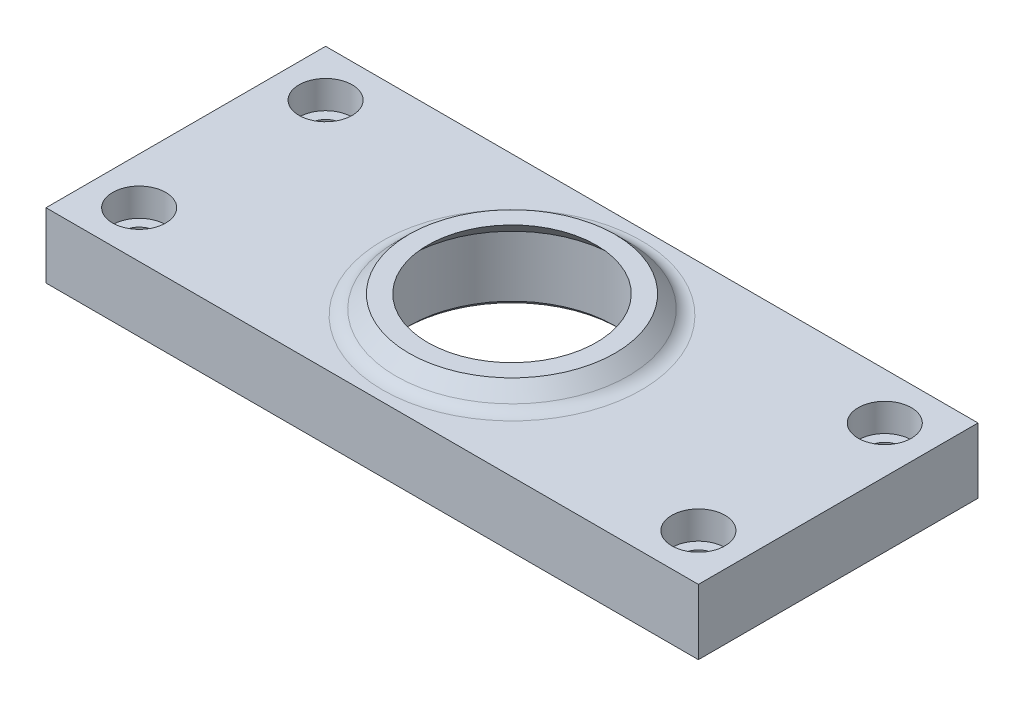
ISO-10303-21;
HEADER;
FILE_DESCRIPTION(('STEP AP214'),'2;1');
FILE_NAME('part.step','',(''),(''),'','','');
FILE_SCHEMA(('AUTOMOTIVE_DESIGN { 1 0 10303 214 1 1 1 1 }'));
ENDSEC;
DATA;
#1=APPLICATION_CONTEXT('core data for automotive mechanical design processes');
#2=APPLICATION_PROTOCOL_DEFINITION('international standard','automotive_design',2000,#1);
#3=PRODUCT_CONTEXT('',#1,'mechanical');
#4=PRODUCT('Part','Part','',(#3));
#5=PRODUCT_RELATED_PRODUCT_CATEGORY('part','',(#4));
#6=PRODUCT_DEFINITION_FORMATION('','',#4);
#7=PRODUCT_DEFINITION_CONTEXT('part definition',#1,'design');
#8=PRODUCT_DEFINITION('design','',#6,#7);
#9=PRODUCT_DEFINITION_SHAPE('','',#8);
#10=(LENGTH_UNIT() NAMED_UNIT(*) SI_UNIT(.MILLI.,.METRE.));
#11=(NAMED_UNIT(*) PLANE_ANGLE_UNIT() SI_UNIT($,.RADIAN.));
#12=(NAMED_UNIT(*) SI_UNIT($,.STERADIAN.) SOLID_ANGLE_UNIT());
#13=UNCERTAINTY_MEASURE_WITH_UNIT(LENGTH_MEASURE(1.E-05),#10,'distance_accuracy_value','');
#14=(GEOMETRIC_REPRESENTATION_CONTEXT(3) GLOBAL_UNCERTAINTY_ASSIGNED_CONTEXT((#13)) GLOBAL_UNIT_ASSIGNED_CONTEXT((#10,
#11,#12)) REPRESENTATION_CONTEXT('',''));
#15=CARTESIAN_POINT('',(0.,0.,0.));
#16=DIRECTION('',(0.,0.,1.));
#17=DIRECTION('',(1.,0.,0.));
#18=AXIS2_PLACEMENT_3D('',#15,#16,#17);
#19=CARTESIAN_POINT('',(30.,0.,10.));
#20=DIRECTION('',(0.,1.,0.));
#21=DIRECTION('',(0.,0.,1.));
#22=AXIS2_PLACEMENT_3D('',#19,#20,#21);
#23=CYLINDRICAL_SURFACE('',#22,1.7);
#24=CARTESIAN_POINT('',(30.,0.,10.));
#25=DIRECTION('',(0.,-1.,0.));
#26=DIRECTION('',(0.,0.,1.));
#27=AXIS2_PLACEMENT_3D('',#24,#25,#26);
#28=CIRCLE('',#27,1.7);
#29=CARTESIAN_POINT('',(30.,0.,11.7));
#30=VERTEX_POINT('',#29);
#31=EDGE_CURVE('E120',#30,#30,#28,.T.);
#32=ORIENTED_EDGE('',*,*,#31,.T.);
#33=EDGE_LOOP('',(#32));
#34=FACE_BOUND('',#33,.T.);
#35=CARTESIAN_POINT('',(30.,4.,10.));
#36=DIRECTION('',(0.,1.,0.));
#37=DIRECTION('',(0.,0.,1.));
#38=AXIS2_PLACEMENT_3D('',#35,#36,#37);
#39=CIRCLE('',#38,1.7);
#40=CARTESIAN_POINT('',(30.,4.,11.7));
#41=VERTEX_POINT('',#40);
#42=EDGE_CURVE('E182',#41,#41,#39,.T.);
#43=ORIENTED_EDGE('',*,*,#42,.T.);
#44=EDGE_LOOP('',(#43));
#45=FACE_BOUND('',#44,.T.);
#46=ADVANCED_FACE('F49',(#34,#45),#23,.F.);
#47=CARTESIAN_POINT('',(30.,0.,-10.));
#48=DIRECTION('',(0.,1.,0.));
#49=DIRECTION('',(0.,0.,1.));
#50=AXIS2_PLACEMENT_3D('',#47,#48,#49);
#51=CYLINDRICAL_SURFACE('',#50,1.7);
#52=CARTESIAN_POINT('',(30.,0.,-10.));
#53=DIRECTION('',(0.,-1.,0.));
#54=DIRECTION('',(0.,0.,1.));
#55=AXIS2_PLACEMENT_3D('',#52,#53,#54);
#56=CIRCLE('',#55,1.7);
#57=CARTESIAN_POINT('',(30.,0.,-8.3));
#58=VERTEX_POINT('',#57);
#59=EDGE_CURVE('E116',#58,#58,#56,.T.);
#60=ORIENTED_EDGE('',*,*,#59,.T.);
#61=EDGE_LOOP('',(#60));
#62=FACE_BOUND('',#61,.T.);
#63=CARTESIAN_POINT('',(30.,4.,-10.));
#64=DIRECTION('',(0.,1.,0.));
#65=DIRECTION('',(0.,0.,1.));
#66=AXIS2_PLACEMENT_3D('',#63,#64,#65);
#67=CIRCLE('',#66,1.7);
#68=CARTESIAN_POINT('',(30.,4.,-8.3));
#69=VERTEX_POINT('',#68);
#70=EDGE_CURVE('E178',#69,#69,#67,.T.);
#71=ORIENTED_EDGE('',*,*,#70,.T.);
#72=EDGE_LOOP('',(#71));
#73=FACE_BOUND('',#72,.T.);
#74=ADVANCED_FACE('F210',(#62,#73),#51,.F.);
#75=CARTESIAN_POINT('',(-30.,0.,10.));
#76=DIRECTION('',(0.,1.,0.));
#77=DIRECTION('',(0.,0.,1.));
#78=AXIS2_PLACEMENT_3D('',#75,#76,#77);
#79=CYLINDRICAL_SURFACE('',#78,1.7);
#80=CARTESIAN_POINT('',(-30.,0.,10.));
#81=DIRECTION('',(0.,1.,0.));
#82=DIRECTION('',(0.,0.,1.));
#83=AXIS2_PLACEMENT_3D('',#80,#81,#82);
#84=CIRCLE('',#83,1.7);
#85=CARTESIAN_POINT('',(-30.,0.,11.7));
#86=VERTEX_POINT('',#85);
#87=EDGE_CURVE('E150',#86,#86,#84,.T.);
#88=ORIENTED_EDGE('',*,*,#87,.F.);
#89=EDGE_LOOP('',(#88));
#90=FACE_BOUND('',#89,.T.);
#91=CARTESIAN_POINT('',(-30.,4.,10.));
#92=DIRECTION('',(0.,1.,0.));
#93=DIRECTION('',(0.,0.,1.));
#94=AXIS2_PLACEMENT_3D('',#91,#92,#93);
#95=CIRCLE('',#94,1.7);
#96=CARTESIAN_POINT('',(-30.,4.,11.7));
#97=VERTEX_POINT('',#96);
#98=EDGE_CURVE('E154',#97,#97,#95,.F.);
#99=ORIENTED_EDGE('',*,*,#98,.F.);
#100=EDGE_LOOP('',(#99));
#101=FACE_BOUND('',#100,.T.);
#102=ADVANCED_FACE('F216',(#90,#101),#79,.F.);
#103=CARTESIAN_POINT('',(-30.,0.,-10.));
#104=DIRECTION('',(0.,1.,0.));
#105=DIRECTION('',(0.,0.,1.));
#106=AXIS2_PLACEMENT_3D('',#103,#104,#105);
#107=CYLINDRICAL_SURFACE('',#106,1.7);
#108=CARTESIAN_POINT('',(-30.,0.,-10.));
#109=DIRECTION('',(0.,1.,0.));
#110=DIRECTION('',(0.,0.,1.));
#111=AXIS2_PLACEMENT_3D('',#108,#109,#110);
#112=CIRCLE('',#111,1.7);
#113=CARTESIAN_POINT('',(-30.,0.,-8.3));
#114=VERTEX_POINT('',#113);
#115=EDGE_CURVE('E145',#114,#114,#112,.T.);
#116=ORIENTED_EDGE('',*,*,#115,.F.);
#117=EDGE_LOOP('',(#116));
#118=FACE_BOUND('',#117,.T.);
#119=CARTESIAN_POINT('',(-30.,4.,-10.));
#120=DIRECTION('',(0.,1.,0.));
#121=DIRECTION('',(0.,0.,1.));
#122=AXIS2_PLACEMENT_3D('',#119,#120,#121);
#123=CIRCLE('',#122,1.7);
#124=CARTESIAN_POINT('',(-30.,4.,-8.3));
#125=VERTEX_POINT('',#124);
#126=EDGE_CURVE('E132',#125,#125,#123,.F.);
#127=ORIENTED_EDGE('',*,*,#126,.F.);
#128=EDGE_LOOP('',(#127));
#129=FACE_BOUND('',#128,.T.);
#130=ADVANCED_FACE('F243',(#118,#129),#107,.F.);
#131=CARTESIAN_POINT('',(0.,7.,0.));
#132=DIRECTION('',(0.,1.,0.));
#133=DIRECTION('',(0.,0.,1.));
#134=AXIS2_PLACEMENT_3D('',#131,#132,#133);
#135=PLANE('',#134);
#136=CARTESIAN_POINT('',(0.,7.,0.));
#137=DIRECTION('',(0.,1.,0.));
#138=DIRECTION('',(0.,0.,1.));
#139=AXIS2_PLACEMENT_3D('',#136,#137,#138);
#140=CIRCLE('',#139,13.8784271247462);
#141=CARTESIAN_POINT('',(0.,7.,13.8784271247462));
#142=VERTEX_POINT('',#141);
#143=EDGE_CURVE('E190',#142,#142,#140,.F.);
#144=ORIENTED_EDGE('',*,*,#143,.T.);
#145=EDGE_LOOP('',(#144));
#146=FACE_BOUND('',#145,.T.);
#147=CARTESIAN_POINT('',(30.,7.,-10.));
#148=DIRECTION('',(0.,-1.,0.));
#149=DIRECTION('',(0.,0.,1.));
#150=AXIS2_PLACEMENT_3D('',#147,#148,#149);
#151=CIRCLE('',#150,2.85);
#152=CARTESIAN_POINT('',(30.,7.,-7.15));
#153=VERTEX_POINT('',#152);
#154=EDGE_CURVE('E567',#153,#153,#151,.T.);
#155=ORIENTED_EDGE('',*,*,#154,.T.);
#156=EDGE_LOOP('',(#155));
#157=FACE_BOUND('',#156,.T.);
#158=CARTESIAN_POINT('',(30.,7.,10.));
#159=DIRECTION('',(0.,-1.,0.));
#160=DIRECTION('',(0.,0.,1.));
#161=AXIS2_PLACEMENT_3D('',#158,#159,#160);
#162=CIRCLE('',#161,2.85);
#163=CARTESIAN_POINT('',(30.,7.,12.85));
#164=VERTEX_POINT('',#163);
#165=EDGE_CURVE('E563',#164,#164,#162,.T.);
#166=ORIENTED_EDGE('',*,*,#165,.T.);
#167=EDGE_LOOP('',(#166));
#168=FACE_BOUND('',#167,.T.);
#169=CARTESIAN_POINT('',(-30.,7.,-10.));
#170=DIRECTION('',(0.,1.,0.));
#171=DIRECTION('',(0.,0.,1.));
#172=AXIS2_PLACEMENT_3D('',#169,#170,#171);
#173=CIRCLE('',#172,2.85);
#174=CARTESIAN_POINT('',(-30.,7.,-7.15));
#175=VERTEX_POINT('',#174);
#176=EDGE_CURVE('E133',#175,#175,#173,.T.);
#177=ORIENTED_EDGE('',*,*,#176,.F.);
#178=EDGE_LOOP('',(#177));
#179=FACE_BOUND('',#178,.T.);
#180=CARTESIAN_POINT('',(-30.,7.,10.));
#181=DIRECTION('',(0.,1.,0.));
#182=DIRECTION('',(0.,0.,1.));
#183=AXIS2_PLACEMENT_3D('',#180,#181,#182);
#184=CIRCLE('',#183,2.85);
#185=CARTESIAN_POINT('',(-30.,7.,12.85));
#186=VERTEX_POINT('',#185);
#187=EDGE_CURVE('E137',#186,#186,#184,.T.);
#188=ORIENTED_EDGE('',*,*,#187,.F.);
#189=EDGE_LOOP('',(#188));
#190=FACE_BOUND('',#189,.T.);
#191=DIRECTION('',(1.,0.,0.));
#192=VECTOR('',#191,1.);
#193=CARTESIAN_POINT('',(0.,7.,15.));
#194=LINE('',#193,#192);
#195=CARTESIAN_POINT('',(-35.,7.,15.));
#196=VERTEX_POINT('',#195);
#197=CARTESIAN_POINT('',(35.,7.,15.));
#198=VERTEX_POINT('',#197);
#199=EDGE_CURVE('E91',#196,#198,#194,.T.);
#200=ORIENTED_EDGE('',*,*,#199,.T.);
#201=DIRECTION('',(0.,0.,1.));
#202=VECTOR('',#201,1.);
#203=CARTESIAN_POINT('',(35.,7.,15.));
#204=LINE('',#203,#202);
#205=CARTESIAN_POINT('',(35.,7.,-15.));
#206=VERTEX_POINT('',#205);
#207=EDGE_CURVE('E96',#206,#198,#204,.T.);
#208=ORIENTED_EDGE('',*,*,#207,.F.);
#209=DIRECTION('',(-1.,0.,0.));
#210=VECTOR('',#209,1.);
#211=CARTESIAN_POINT('',(-35.,7.,-15.));
#212=LINE('',#211,#210);
#213=CARTESIAN_POINT('',(-35.,7.,-15.));
#214=VERTEX_POINT('',#213);
#215=EDGE_CURVE('E149',#206,#214,#212,.T.);
#216=ORIENTED_EDGE('',*,*,#215,.T.);
#217=DIRECTION('',(0.,0.,1.));
#218=VECTOR('',#217,1.);
#219=CARTESIAN_POINT('',(-35.,7.,15.));
#220=LINE('',#219,#218);
#221=EDGE_CURVE('E98',#214,#196,#220,.T.);
#222=ORIENTED_EDGE('',*,*,#221,.T.);
#223=EDGE_LOOP('',(#200,#208,#216,#222));
#224=FACE_BOUND('',#223,.T.);
#225=ADVANCED_FACE('F93',(#146,#157,#168,#179,#190,#224),#135,.T.);
#226=CARTESIAN_POINT('',(0.,0.,0.));
#227=DIRECTION('',(0.,1.,0.));
#228=DIRECTION('',(0.,0.,1.));
#229=AXIS2_PLACEMENT_3D('',#226,#227,#228);
#230=PLANE('',#229);
#231=CARTESIAN_POINT('',(0.,0.,0.));
#232=DIRECTION('',(0.,1.,0.));
#233=DIRECTION('',(0.,0.,1.));
#234=AXIS2_PLACEMENT_3D('',#231,#232,#233);
#235=CIRCLE('',#234,11.55);
#236=CARTESIAN_POINT('',(0.,0.,11.55));
#237=VERTEX_POINT('',#236);
#238=EDGE_CURVE('E59',#237,#237,#235,.T.);
#239=ORIENTED_EDGE('',*,*,#238,.T.);
#240=EDGE_LOOP('',(#239));
#241=FACE_BOUND('',#240,.T.);
#242=ORIENTED_EDGE('',*,*,#59,.F.);
#243=EDGE_LOOP('',(#242));
#244=FACE_BOUND('',#243,.T.);
#245=ORIENTED_EDGE('',*,*,#31,.F.);
#246=EDGE_LOOP('',(#245));
#247=FACE_BOUND('',#246,.T.);
#248=ORIENTED_EDGE('',*,*,#115,.T.);
#249=EDGE_LOOP('',(#248));
#250=FACE_BOUND('',#249,.T.);
#251=ORIENTED_EDGE('',*,*,#87,.T.);
#252=EDGE_LOOP('',(#251));
#253=FACE_BOUND('',#252,.T.);
#254=DIRECTION('',(1.,0.,0.));
#255=VECTOR('',#254,1.);
#256=CARTESIAN_POINT('',(-35.,0.,-15.));
#257=LINE('',#256,#255);
#258=CARTESIAN_POINT('',(-35.,0.,-15.));
#259=VERTEX_POINT('',#258);
#260=CARTESIAN_POINT('',(35.,0.,-15.));
#261=VERTEX_POINT('',#260);
#262=EDGE_CURVE('E160',#259,#261,#257,.T.);
#263=ORIENTED_EDGE('',*,*,#262,.T.);
#264=DIRECTION('',(0.,0.,-1.));
#265=VECTOR('',#264,1.);
#266=CARTESIAN_POINT('',(35.,0.,15.));
#267=LINE('',#266,#265);
#268=CARTESIAN_POINT('',(35.,0.,15.));
#269=VERTEX_POINT('',#268);
#270=EDGE_CURVE('E124',#269,#261,#267,.T.);
#271=ORIENTED_EDGE('',*,*,#270,.F.);
#272=DIRECTION('',(-1.,0.,0.));
#273=VECTOR('',#272,1.);
#274=CARTESIAN_POINT('',(0.,0.,15.));
#275=LINE('',#274,#273);
#276=CARTESIAN_POINT('',(-35.,0.,15.));
#277=VERTEX_POINT('',#276);
#278=EDGE_CURVE('E66',#269,#277,#275,.T.);
#279=ORIENTED_EDGE('',*,*,#278,.T.);
#280=DIRECTION('',(0.,0.,-1.));
#281=VECTOR('',#280,1.);
#282=CARTESIAN_POINT('',(-35.,0.,15.));
#283=LINE('',#282,#281);
#284=EDGE_CURVE('E70',#277,#259,#283,.T.);
#285=ORIENTED_EDGE('',*,*,#284,.T.);
#286=EDGE_LOOP('',(#263,#271,#279,#285));
#287=FACE_BOUND('',#286,.T.);
#288=ADVANCED_FACE('F197',(#241,#244,#247,#250,#253,#287),#230,.F.);
#289=CARTESIAN_POINT('',(0.,7.,0.));
#290=DIRECTION('',(0.,-1.,0.));
#291=DIRECTION('',(0.,0.,-1.));
#292=AXIS2_PLACEMENT_3D('',#289,#290,#291);
#293=CYLINDRICAL_SURFACE('',#292,11.05);
#294=CARTESIAN_POINT('',(0.,0.500000000000007,0.));
#295=DIRECTION('',(0.,1.,0.));
#296=DIRECTION('',(0.,0.,1.));
#297=AXIS2_PLACEMENT_3D('',#294,#295,#296);
#298=CIRCLE('',#297,11.05);
#299=CARTESIAN_POINT('',(0.,0.500000000000007,11.05));
#300=VERTEX_POINT('',#299);
#301=EDGE_CURVE('E11',#300,#300,#298,.F.);
#302=ORIENTED_EDGE('',*,*,#301,.T.);
#303=EDGE_LOOP('',(#302));
#304=FACE_BOUND('',#303,.T.);
#305=CARTESIAN_POINT('',(0.,7.,0.));
#306=DIRECTION('',(0.,1.,0.));
#307=DIRECTION('',(0.,0.,1.));
#308=AXIS2_PLACEMENT_3D('',#305,#306,#307);
#309=CIRCLE('',#308,11.05);
#310=CARTESIAN_POINT('',(0.,7.,11.05));
#311=VERTEX_POINT('',#310);
#312=EDGE_CURVE('E557',#311,#311,#309,.T.);
#313=ORIENTED_EDGE('',*,*,#312,.T.);
#314=EDGE_LOOP('',(#313));
#315=FACE_BOUND('',#314,.T.);
#316=ADVANCED_FACE('F253',(#304,#315),#293,.F.);
#317=CARTESIAN_POINT('',(0.,-46.0977222864644,15.));
#318=DIRECTION('',(0.,0.,1.));
#319=DIRECTION('',(1.,0.,0.));
#320=AXIS2_PLACEMENT_3D('',#317,#318,#319);
#321=PLANE('',#320);
#322=ORIENTED_EDGE('',*,*,#278,.F.);
#323=DIRECTION('',(0.,1.,0.));
#324=VECTOR('',#323,1.);
#325=CARTESIAN_POINT('',(35.,-46.0977222864644,15.));
#326=LINE('',#325,#324);
#327=EDGE_CURVE('E105',#269,#198,#326,.T.);
#328=ORIENTED_EDGE('',*,*,#327,.T.);
#329=ORIENTED_EDGE('',*,*,#199,.F.);
#330=DIRECTION('',(0.,1.,0.));
#331=VECTOR('',#330,1.);
#332=CARTESIAN_POINT('',(-35.,-46.0977222864644,15.));
#333=LINE('',#332,#331);
#334=EDGE_CURVE('E157',#277,#196,#333,.T.);
#335=ORIENTED_EDGE('',*,*,#334,.F.);
#336=EDGE_LOOP('',(#322,#328,#329,#335));
#337=FACE_BOUND('',#336,.T.);
#338=ADVANCED_FACE('F106',(#337),#321,.T.);
#339=CARTESIAN_POINT('',(-35.,-46.0977222864644,15.));
#340=DIRECTION('',(-1.,0.,0.));
#341=DIRECTION('',(0.,0.,1.));
#342=AXIS2_PLACEMENT_3D('',#339,#340,#341);
#343=PLANE('',#342);
#344=ORIENTED_EDGE('',*,*,#284,.F.);
#345=ORIENTED_EDGE('',*,*,#334,.T.);
#346=ORIENTED_EDGE('',*,*,#221,.F.);
#347=DIRECTION('',(0.,1.,0.));
#348=VECTOR('',#347,1.);
#349=CARTESIAN_POINT('',(-35.,-46.0977222864644,-15.));
#350=LINE('',#349,#348);
#351=EDGE_CURVE('E102',#259,#214,#350,.T.);
#352=ORIENTED_EDGE('',*,*,#351,.F.);
#353=EDGE_LOOP('',(#344,#345,#346,#352));
#354=FACE_BOUND('',#353,.T.);
#355=ADVANCED_FACE('F252',(#354),#343,.T.);
#356=CARTESIAN_POINT('',(-35.,-46.0977222864644,-15.));
#357=DIRECTION('',(0.,0.,-1.));
#358=DIRECTION('',(-1.,0.,0.));
#359=AXIS2_PLACEMENT_3D('',#356,#357,#358);
#360=PLANE('',#359);
#361=ORIENTED_EDGE('',*,*,#262,.F.);
#362=ORIENTED_EDGE('',*,*,#351,.T.);
#363=ORIENTED_EDGE('',*,*,#215,.F.);
#364=DIRECTION('',(0.,1.,0.));
#365=VECTOR('',#364,1.);
#366=CARTESIAN_POINT('',(35.,-46.0977222864644,-15.));
#367=LINE('',#366,#365);
#368=EDGE_CURVE('E110',#261,#206,#367,.T.);
#369=ORIENTED_EDGE('',*,*,#368,.F.);
#370=EDGE_LOOP('',(#361,#362,#363,#369));
#371=FACE_BOUND('',#370,.T.);
#372=ADVANCED_FACE('F231',(#371),#360,.T.);
#373=CARTESIAN_POINT('',(-30.,4.,-10.));
#374=DIRECTION('',(0.,1.,0.));
#375=DIRECTION('',(0.,0.,1.));
#376=AXIS2_PLACEMENT_3D('',#373,#374,#375);
#377=PLANE('',#376);
#378=CARTESIAN_POINT('',(-30.,4.,-10.));
#379=DIRECTION('',(0.,1.,0.));
#380=DIRECTION('',(0.,0.,1.));
#381=AXIS2_PLACEMENT_3D('',#378,#379,#380);
#382=CIRCLE('',#381,2.85);
#383=CARTESIAN_POINT('',(-30.,4.,-7.15));
#384=VERTEX_POINT('',#383);
#385=EDGE_CURVE('E128',#384,#384,#382,.T.);
#386=ORIENTED_EDGE('',*,*,#385,.T.);
#387=EDGE_LOOP('',(#386));
#388=FACE_BOUND('',#387,.T.);
#389=ORIENTED_EDGE('',*,*,#126,.T.);
#390=EDGE_LOOP('',(#389));
#391=FACE_BOUND('',#390,.T.);
#392=ADVANCED_FACE('F227',(#388,#391),#377,.T.);
#393=CARTESIAN_POINT('',(-30.,4.,-10.));
#394=DIRECTION('',(0.,1.,0.));
#395=DIRECTION('',(0.,0.,1.));
#396=AXIS2_PLACEMENT_3D('',#393,#394,#395);
#397=CYLINDRICAL_SURFACE('',#396,2.85);
#398=ORIENTED_EDGE('',*,*,#385,.F.);
#399=EDGE_LOOP('',(#398));
#400=FACE_BOUND('',#399,.T.);
#401=ORIENTED_EDGE('',*,*,#176,.T.);
#402=EDGE_LOOP('',(#401));
#403=FACE_BOUND('',#402,.T.);
#404=ADVANCED_FACE('F230',(#400,#403),#397,.F.);
#405=CARTESIAN_POINT('',(-30.,4.,10.));
#406=DIRECTION('',(0.,1.,0.));
#407=DIRECTION('',(0.,0.,1.));
#408=AXIS2_PLACEMENT_3D('',#405,#406,#407);
#409=PLANE('',#408);
#410=CARTESIAN_POINT('',(-30.,4.,10.));
#411=DIRECTION('',(0.,1.,0.));
#412=DIRECTION('',(0.,0.,1.));
#413=AXIS2_PLACEMENT_3D('',#410,#411,#412);
#414=CIRCLE('',#413,2.85);
#415=CARTESIAN_POINT('',(-30.,4.,12.85));
#416=VERTEX_POINT('',#415);
#417=EDGE_CURVE('E141',#416,#416,#414,.T.);
#418=ORIENTED_EDGE('',*,*,#417,.T.);
#419=EDGE_LOOP('',(#418));
#420=FACE_BOUND('',#419,.T.);
#421=ORIENTED_EDGE('',*,*,#98,.T.);
#422=EDGE_LOOP('',(#421));
#423=FACE_BOUND('',#422,.T.);
#424=ADVANCED_FACE('F235',(#420,#423),#409,.T.);
#425=CARTESIAN_POINT('',(-30.,4.,10.));
#426=DIRECTION('',(0.,1.,0.));
#427=DIRECTION('',(0.,0.,1.));
#428=AXIS2_PLACEMENT_3D('',#425,#426,#427);
#429=CYLINDRICAL_SURFACE('',#428,2.85);
#430=ORIENTED_EDGE('',*,*,#417,.F.);
#431=EDGE_LOOP('',(#430));
#432=FACE_BOUND('',#431,.T.);
#433=ORIENTED_EDGE('',*,*,#187,.T.);
#434=EDGE_LOOP('',(#433));
#435=FACE_BOUND('',#434,.T.);
#436=ADVANCED_FACE('F226',(#432,#435),#429,.F.);
#437=CARTESIAN_POINT('',(35.,-46.0977222864644,15.));
#438=DIRECTION('',(-1.,0.,0.));
#439=DIRECTION('',(0.,0.,1.));
#440=AXIS2_PLACEMENT_3D('',#437,#438,#439);
#441=PLANE('',#440);
#442=ORIENTED_EDGE('',*,*,#327,.F.);
#443=ORIENTED_EDGE('',*,*,#270,.T.);
#444=ORIENTED_EDGE('',*,*,#368,.T.);
#445=ORIENTED_EDGE('',*,*,#207,.T.);
#446=EDGE_LOOP('',(#442,#443,#444,#445));
#447=FACE_BOUND('',#446,.T.);
#448=ADVANCED_FACE('F113',(#447),#441,.F.);
#449=CARTESIAN_POINT('',(30.,4.,-10.));
#450=DIRECTION('',(0.,1.,0.));
#451=DIRECTION('',(0.,0.,1.));
#452=AXIS2_PLACEMENT_3D('',#449,#450,#451);
#453=CYLINDRICAL_SURFACE('',#452,2.85);
#454=CARTESIAN_POINT('',(30.,4.,-10.));
#455=DIRECTION('',(0.,-1.,0.));
#456=DIRECTION('',(0.,0.,1.));
#457=AXIS2_PLACEMENT_3D('',#454,#455,#456);
#458=CIRCLE('',#457,2.85);
#459=CARTESIAN_POINT('',(30.,4.,-7.15));
#460=VERTEX_POINT('',#459);
#461=EDGE_CURVE('E183',#460,#460,#458,.T.);
#462=ORIENTED_EDGE('',*,*,#461,.T.);
#463=EDGE_LOOP('',(#462));
#464=FACE_BOUND('',#463,.T.);
#465=ORIENTED_EDGE('',*,*,#154,.F.);
#466=EDGE_LOOP('',(#465));
#467=FACE_BOUND('',#466,.T.);
#468=ADVANCED_FACE('F225',(#464,#467),#453,.F.);
#469=CARTESIAN_POINT('',(30.,4.,-10.));
#470=DIRECTION('',(0.,1.,0.));
#471=DIRECTION('',(0.,0.,1.));
#472=AXIS2_PLACEMENT_3D('',#469,#470,#471);
#473=PLANE('',#472);
#474=ORIENTED_EDGE('',*,*,#70,.F.);
#475=EDGE_LOOP('',(#474));
#476=FACE_BOUND('',#475,.T.);
#477=ORIENTED_EDGE('',*,*,#461,.F.);
#478=EDGE_LOOP('',(#477));
#479=FACE_BOUND('',#478,.T.);
#480=ADVANCED_FACE('F313',(#476,#479),#473,.T.);
#481=CARTESIAN_POINT('',(30.,4.,10.));
#482=DIRECTION('',(0.,1.,0.));
#483=DIRECTION('',(0.,0.,1.));
#484=AXIS2_PLACEMENT_3D('',#481,#482,#483);
#485=CYLINDRICAL_SURFACE('',#484,2.85);
#486=CARTESIAN_POINT('',(30.,4.,10.));
#487=DIRECTION('',(0.,-1.,0.));
#488=DIRECTION('',(0.,0.,1.));
#489=AXIS2_PLACEMENT_3D('',#486,#487,#488);
#490=CIRCLE('',#489,2.85);
#491=CARTESIAN_POINT('',(30.,4.,12.85));
#492=VERTEX_POINT('',#491);
#493=EDGE_CURVE('E571',#492,#492,#490,.T.);
#494=ORIENTED_EDGE('',*,*,#493,.T.);
#495=EDGE_LOOP('',(#494));
#496=FACE_BOUND('',#495,.T.);
#497=ORIENTED_EDGE('',*,*,#165,.F.);
#498=EDGE_LOOP('',(#497));
#499=FACE_BOUND('',#498,.T.);
#500=ADVANCED_FACE('F321',(#496,#499),#485,.F.);
#501=CARTESIAN_POINT('',(30.,4.,10.));
#502=DIRECTION('',(0.,1.,0.));
#503=DIRECTION('',(0.,0.,1.));
#504=AXIS2_PLACEMENT_3D('',#501,#502,#503);
#505=PLANE('',#504);
#506=ORIENTED_EDGE('',*,*,#42,.F.);
#507=EDGE_LOOP('',(#506));
#508=FACE_BOUND('',#507,.T.);
#509=ORIENTED_EDGE('',*,*,#493,.F.);
#510=EDGE_LOOP('',(#509));
#511=FACE_BOUND('',#510,.T.);
#512=ADVANCED_FACE('F329',(#508,#511),#505,.T.);
#513=CARTESIAN_POINT('',(0.,9.,0.));
#514=DIRECTION('',(0.,-1.,0.));
#515=DIRECTION('',(0.,0.,-1.));
#516=AXIS2_PLACEMENT_3D('',#513,#514,#515);
#517=CONICAL_SURFACE('',#516,9.05,0.785398163397449);
#518=ORIENTED_EDGE('',*,*,#312,.F.);
#519=EDGE_LOOP('',(#518));
#520=FACE_BOUND('',#519,.T.);
#521=CARTESIAN_POINT('',(0.,9.,0.));
#522=DIRECTION('',(0.,1.,0.));
#523=DIRECTION('',(0.,0.,1.));
#524=AXIS2_PLACEMENT_3D('',#521,#522,#523);
#525=CIRCLE('',#524,9.05);
#526=CARTESIAN_POINT('',(0.,9.,9.05));
#527=VERTEX_POINT('',#526);
#528=EDGE_CURVE('E553',#527,#527,#525,.T.);
#529=ORIENTED_EDGE('',*,*,#528,.T.);
#530=EDGE_LOOP('',(#529));
#531=FACE_BOUND('',#530,.T.);
#532=ADVANCED_FACE('F336',(#520,#531),#517,.F.);
#533=CARTESIAN_POINT('',(9.05,9.,0.));
#534=DIRECTION('',(0.,-1.,0.));
#535=DIRECTION('',(0.,0.,-1.));
#536=AXIS2_PLACEMENT_3D('',#533,#534,#535);
#537=PLANE('',#536);
#538=ORIENTED_EDGE('',*,*,#528,.F.);
#539=EDGE_LOOP('',(#538));
#540=FACE_BOUND('',#539,.T.);
#541=CARTESIAN_POINT('',(0.,9.,0.));
#542=DIRECTION('',(0.,1.,0.));
#543=DIRECTION('',(0.,0.,1.));
#544=AXIS2_PLACEMENT_3D('',#541,#542,#543);
#545=CIRCLE('',#544,11.05);
#546=CARTESIAN_POINT('',(0.,9.,11.05));
#547=VERTEX_POINT('',#546);
#548=EDGE_CURVE('E550',#547,#547,#545,.T.);
#549=ORIENTED_EDGE('',*,*,#548,.T.);
#550=EDGE_LOOP('',(#549));
#551=FACE_BOUND('',#550,.T.);
#552=ADVANCED_FACE('F344',(#540,#551),#537,.F.);
#553=CARTESIAN_POINT('',(0.,7.,0.));
#554=DIRECTION('',(0.,-1.,0.));
#555=DIRECTION('',(0.,0.,-1.));
#556=AXIS2_PLACEMENT_3D('',#553,#554,#555);
#557=CONICAL_SURFACE('',#556,13.05,0.785398163397448);
#558=CARTESIAN_POINT('',(0.,7.58578643762691,0.));
#559=DIRECTION('',(0.,1.,0.));
#560=DIRECTION('',(0.,0.,1.));
#561=AXIS2_PLACEMENT_3D('',#558,#559,#560);
#562=CIRCLE('',#561,12.4642135623731);
#563=CARTESIAN_POINT('',(0.,7.58578643762691,12.4642135623731));
#564=VERTEX_POINT('',#563);
#565=EDGE_CURVE('E171',#564,#564,#562,.T.);
#566=ORIENTED_EDGE('',*,*,#565,.T.);
#567=EDGE_LOOP('',(#566));
#568=FACE_BOUND('',#567,.T.);
#569=ORIENTED_EDGE('',*,*,#548,.F.);
#570=EDGE_LOOP('',(#569));
#571=FACE_BOUND('',#570,.T.);
#572=ADVANCED_FACE('F206',(#568,#571),#557,.T.);
#573=CARTESIAN_POINT('',(0.,9.,0.));
#574=DIRECTION('',(0.,1.,0.));
#575=DIRECTION('',(0.,0.,1.));
#576=AXIS2_PLACEMENT_3D('',#573,#574,#575);
#577=TOROIDAL_SURFACE('',#576,13.8784271247462,2.);
#578=ORIENTED_EDGE('',*,*,#143,.F.);
#579=EDGE_LOOP('',(#578));
#580=FACE_BOUND('',#579,.T.);
#581=ORIENTED_EDGE('',*,*,#565,.F.);
#582=EDGE_LOOP('',(#581));
#583=FACE_BOUND('',#582,.T.);
#584=ADVANCED_FACE('F201',(#580,#583),#577,.F.);
#585=CARTESIAN_POINT('',(0.,0.,0.));
#586=DIRECTION('',(0.,-1.,0.));
#587=DIRECTION('',(0.,0.,-1.));
#588=AXIS2_PLACEMENT_3D('',#585,#586,#587);
#589=CONICAL_SURFACE('',#588,11.55,0.785398163397452);
#590=ORIENTED_EDGE('',*,*,#301,.F.);
#591=EDGE_LOOP('',(#590));
#592=FACE_BOUND('',#591,.T.);
#593=ORIENTED_EDGE('',*,*,#238,.F.);
#594=EDGE_LOOP('',(#593));
#595=FACE_BOUND('',#594,.T.);
#596=ADVANCED_FACE('F52',(#592,#595),#589,.F.);
#597=CLOSED_SHELL('',(#46,#74,#102,#130,#225,#288,#316,#338,#355,#372,#392,#404,#424,#436,#448,
#468,#480,#500,#512,#532,#552,#572,#584,#596));
#598=MANIFOLD_SOLID_BREP('B2',#597);
#599=ADVANCED_BREP_SHAPE_REPRESENTATION('',(#18,#598),#14);
#600=SHAPE_DEFINITION_REPRESENTATION(#9,#599);
ENDSEC;
END-ISO-10303-21;
